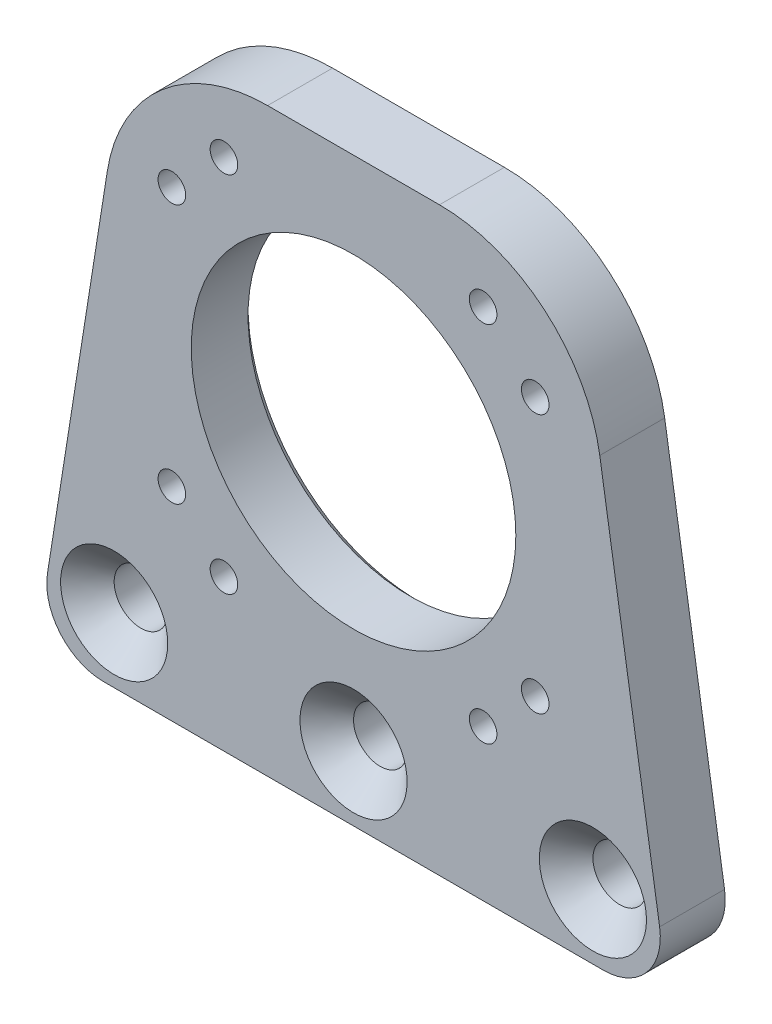
ISO-10303-21;
HEADER;
FILE_DESCRIPTION(('STEP AP214'),'2;1');
FILE_NAME('part.step','',(''),(''),'','','');
FILE_SCHEMA(('AUTOMOTIVE_DESIGN { 1 0 10303 214 1 1 1 1 }'));
ENDSEC;
DATA;
#1=APPLICATION_CONTEXT('core data for automotive mechanical design processes');
#2=APPLICATION_PROTOCOL_DEFINITION('international standard','automotive_design',2000,#1);
#3=PRODUCT_CONTEXT('',#1,'mechanical');
#4=PRODUCT('Part','Part','',(#3));
#5=PRODUCT_RELATED_PRODUCT_CATEGORY('part','',(#4));
#6=PRODUCT_DEFINITION_FORMATION('','',#4);
#7=PRODUCT_DEFINITION_CONTEXT('part definition',#1,'design');
#8=PRODUCT_DEFINITION('design','',#6,#7);
#9=PRODUCT_DEFINITION_SHAPE('','',#8);
#10=(LENGTH_UNIT() NAMED_UNIT(*) SI_UNIT(.MILLI.,.METRE.));
#11=(NAMED_UNIT(*) PLANE_ANGLE_UNIT() SI_UNIT($,.RADIAN.));
#12=(NAMED_UNIT(*) SI_UNIT($,.STERADIAN.) SOLID_ANGLE_UNIT());
#13=UNCERTAINTY_MEASURE_WITH_UNIT(LENGTH_MEASURE(1.E-05),#10,'distance_accuracy_value','');
#14=(GEOMETRIC_REPRESENTATION_CONTEXT(3) GLOBAL_UNCERTAINTY_ASSIGNED_CONTEXT((#13)) GLOBAL_UNIT_ASSIGNED_CONTEXT((#10,
#11,#12)) REPRESENTATION_CONTEXT('',''));
#15=CARTESIAN_POINT('',(0.,0.,0.));
#16=DIRECTION('',(0.,0.,1.));
#17=DIRECTION('',(1.,0.,0.));
#18=AXIS2_PLACEMENT_3D('',#15,#16,#17);
#19=CARTESIAN_POINT('',(-30.8054963273457,13.8,0.));
#20=DIRECTION('',(0.,0.,1.));
#21=DIRECTION('',(1.,0.,0.));
#22=AXIS2_PLACEMENT_3D('',#19,#20,#21);
#23=PLANE('',#22);
#24=CARTESIAN_POINT('',(0.,47.8,0.));
#25=DIRECTION('',(0.,0.,1.));
#26=DIRECTION('',(1.,0.,0.));
#27=AXIS2_PLACEMENT_3D('',#24,#25,#26);
#28=CIRCLE('',#27,21.);
#29=CARTESIAN_POINT('',(21.,47.8,0.));
#30=VERTEX_POINT('',#29);
#31=EDGE_CURVE('E47',#30,#30,#28,.T.);
#32=ORIENTED_EDGE('',*,*,#31,.T.);
#33=EDGE_LOOP('',(#32));
#34=FACE_BOUND('',#33,.T.);
#35=CARTESIAN_POINT('',(29.5,14.8,0.));
#36=DIRECTION('',(0.,0.,1.));
#37=DIRECTION('',(1.,0.,0.));
#38=AXIS2_PLACEMENT_3D('',#35,#36,#37);
#39=CIRCLE('',#38,3.3);
#40=CARTESIAN_POINT('',(32.8,14.8,0.));
#41=VERTEX_POINT('',#40);
#42=EDGE_CURVE('E215',#41,#41,#39,.T.);
#43=ORIENTED_EDGE('',*,*,#42,.T.);
#44=EDGE_LOOP('',(#43));
#45=FACE_BOUND('',#44,.T.);
#46=CARTESIAN_POINT('',(0.,14.8,0.));
#47=DIRECTION('',(0.,0.,1.));
#48=DIRECTION('',(1.,0.,0.));
#49=AXIS2_PLACEMENT_3D('',#46,#47,#48);
#50=CIRCLE('',#49,3.3);
#51=CARTESIAN_POINT('',(3.3,14.8,0.));
#52=VERTEX_POINT('',#51);
#53=EDGE_CURVE('E210',#52,#52,#50,.T.);
#54=ORIENTED_EDGE('',*,*,#53,.T.);
#55=EDGE_LOOP('',(#54));
#56=FACE_BOUND('',#55,.T.);
#57=CARTESIAN_POINT('',(-29.5,14.8,0.));
#58=DIRECTION('',(0.,0.,1.));
#59=DIRECTION('',(1.,0.,0.));
#60=AXIS2_PLACEMENT_3D('',#57,#58,#59);
#61=CIRCLE('',#60,3.3);
#62=CARTESIAN_POINT('',(-26.2,14.8,0.));
#63=VERTEX_POINT('',#62);
#64=EDGE_CURVE('E205',#63,#63,#61,.T.);
#65=ORIENTED_EDGE('',*,*,#64,.T.);
#66=EDGE_LOOP('',(#65));
#67=FACE_BOUND('',#66,.T.);
#68=CARTESIAN_POINT('',(15.9693312820508,25.4118232452012,0.));
#69=DIRECTION('',(0.,0.,-1.));
#70=DIRECTION('',(-1.,0.,0.));
#71=AXIS2_PLACEMENT_3D('',#68,#69,#70);
#72=CIRCLE('',#71,3.3);
#73=CARTESIAN_POINT('',(12.6693312820508,25.4118232452012,0.));
#74=VERTEX_POINT('',#73);
#75=EDGE_CURVE('E183',#74,#74,#72,.T.);
#76=ORIENTED_EDGE('',*,*,#75,.F.);
#77=EDGE_LOOP('',(#76));
#78=FACE_BOUND('',#77,.T.);
#79=CARTESIAN_POINT('',(-30.8054963273457,13.8,0.));
#80=DIRECTION('',(0.,0.,1.));
#81=DIRECTION('',(1.,0.,0.));
#82=AXIS2_PLACEMENT_3D('',#79,#80,#81);
#83=CIRCLE('',#82,7.);
#84=CARTESIAN_POINT('',(-37.7195050868033,14.89383859602,0.));
#85=VERTEX_POINT('',#84);
#86=CARTESIAN_POINT('',(-30.8054963273457,6.80000000000001,0.));
#87=VERTEX_POINT('',#86);
#88=EDGE_CURVE('E136',#85,#87,#83,.T.);
#89=ORIENTED_EDGE('',*,*,#88,.F.);
#90=DIRECTION('',(-0.156262656574284,-0.987715537065378,0.));
#91=VECTOR('',#90,1.);
#92=CARTESIAN_POINT('',(-37.7195050868033,14.89383859602,0.));
#93=LINE('',#92,#91);
#94=CARTESIAN_POINT('',(-30.3437932099042,61.5147356000824,0.));
#95=VERTEX_POINT('',#94);
#96=EDGE_CURVE('E90',#95,#85,#93,.T.);
#97=ORIENTED_EDGE('',*,*,#96,.F.);
#98=CARTESIAN_POINT('',(-10.5894824685967,58.3894824685967,0.));
#99=DIRECTION('',(0.,0.,1.));
#100=DIRECTION('',(-1.,0.,0.));
#101=AXIS2_PLACEMENT_3D('',#98,#99,#100);
#102=CIRCLE('',#101,20.);
#103=CARTESIAN_POINT('',(-10.5894824685967,78.3894824685967,0.));
#104=VERTEX_POINT('',#103);
#105=EDGE_CURVE('E84',#104,#95,#102,.T.);
#106=ORIENTED_EDGE('',*,*,#105,.F.);
#107=DIRECTION('',(-1.,0.,0.));
#108=VECTOR('',#107,1.);
#109=CARTESIAN_POINT('',(-10.5894824685967,78.3894824685967,0.));
#110=LINE('',#109,#108);
#111=CARTESIAN_POINT('',(10.5894824685967,78.3894824685967,0.));
#112=VERTEX_POINT('',#111);
#113=EDGE_CURVE('E126',#112,#104,#110,.T.);
#114=ORIENTED_EDGE('',*,*,#113,.F.);
#115=CARTESIAN_POINT('',(10.5894824685967,58.3894824685967,0.));
#116=DIRECTION('',(0.,0.,1.));
#117=DIRECTION('',(1.,0.,0.));
#118=AXIS2_PLACEMENT_3D('',#115,#116,#117);
#119=CIRCLE('',#118,20.);
#120=CARTESIAN_POINT('',(30.3437932099042,61.5147356000824,0.));
#121=VERTEX_POINT('',#120);
#122=EDGE_CURVE('E146',#121,#112,#119,.T.);
#123=ORIENTED_EDGE('',*,*,#122,.F.);
#124=DIRECTION('',(-0.156262656574284,0.987715537065378,0.));
#125=VECTOR('',#124,1.);
#126=CARTESIAN_POINT('',(37.7195050868033,14.89383859602,0.));
#127=LINE('',#126,#125);
#128=CARTESIAN_POINT('',(37.7195050868033,14.89383859602,0.));
#129=VERTEX_POINT('',#128);
#130=EDGE_CURVE('E144',#129,#121,#127,.T.);
#131=ORIENTED_EDGE('',*,*,#130,.F.);
#132=CARTESIAN_POINT('',(30.8054963273457,13.8,0.));
#133=DIRECTION('',(0.,0.,1.));
#134=DIRECTION('',(-1.,0.,0.));
#135=AXIS2_PLACEMENT_3D('',#132,#133,#134);
#136=CIRCLE('',#135,7.00000000000001);
#137=CARTESIAN_POINT('',(30.8054963273457,6.8,0.));
#138=VERTEX_POINT('',#137);
#139=EDGE_CURVE('E142',#138,#129,#136,.T.);
#140=ORIENTED_EDGE('',*,*,#139,.F.);
#141=DIRECTION('',(1.,0.,0.));
#142=VECTOR('',#141,1.);
#143=CARTESIAN_POINT('',(-30.8054963273457,6.80000000000001,0.));
#144=LINE('',#143,#142);
#145=EDGE_CURVE('E139',#87,#138,#144,.T.);
#146=ORIENTED_EDGE('',*,*,#145,.F.);
#147=EDGE_LOOP('',(#89,#97,#106,#114,#123,#131,#140,#146));
#148=FACE_BOUND('',#147,.T.);
#149=CARTESIAN_POINT('',(-22.3881767547988,31.8306687179492,0.));
#150=DIRECTION('',(0.,0.,-1.));
#151=DIRECTION('',(-1.,0.,0.));
#152=AXIS2_PLACEMENT_3D('',#149,#150,#151);
#153=CIRCLE('',#152,3.3);
#154=CARTESIAN_POINT('',(-25.6881767547988,31.8306687179492,0.));
#155=VERTEX_POINT('',#154);
#156=EDGE_CURVE('E173',#155,#155,#153,.T.);
#157=ORIENTED_EDGE('',*,*,#156,.F.);
#158=EDGE_LOOP('',(#157));
#159=FACE_BOUND('',#158,.T.);
#160=CARTESIAN_POINT('',(-15.9693312820508,25.4118232452012,0.));
#161=DIRECTION('',(0.,0.,-1.));
#162=DIRECTION('',(-1.,0.,0.));
#163=AXIS2_PLACEMENT_3D('',#160,#161,#162);
#164=CIRCLE('',#163,3.3);
#165=CARTESIAN_POINT('',(-19.2693312820508,25.4118232452012,0.));
#166=VERTEX_POINT('',#165);
#167=EDGE_CURVE('E178',#166,#166,#164,.T.);
#168=ORIENTED_EDGE('',*,*,#167,.F.);
#169=EDGE_LOOP('',(#168));
#170=FACE_BOUND('',#169,.T.);
#171=CARTESIAN_POINT('',(22.3881767547988,31.8306687179492,0.));
#172=DIRECTION('',(0.,0.,-1.));
#173=DIRECTION('',(-1.,0.,0.));
#174=AXIS2_PLACEMENT_3D('',#171,#172,#173);
#175=CIRCLE('',#174,3.3);
#176=CARTESIAN_POINT('',(19.0881767547988,31.8306687179492,0.));
#177=VERTEX_POINT('',#176);
#178=EDGE_CURVE('E188',#177,#177,#175,.T.);
#179=ORIENTED_EDGE('',*,*,#178,.F.);
#180=EDGE_LOOP('',(#179));
#181=FACE_BOUND('',#180,.T.);
#182=CARTESIAN_POINT('',(-22.3881767547988,63.7693312820508,0.));
#183=DIRECTION('',(0.,0.,-1.));
#184=DIRECTION('',(-1.,0.,0.));
#185=AXIS2_PLACEMENT_3D('',#182,#183,#184);
#186=CIRCLE('',#185,3.3);
#187=CARTESIAN_POINT('',(-25.6881767547988,63.7693312820508,0.));
#188=VERTEX_POINT('',#187);
#189=EDGE_CURVE('E193',#188,#188,#186,.T.);
#190=ORIENTED_EDGE('',*,*,#189,.F.);
#191=EDGE_LOOP('',(#190));
#192=FACE_BOUND('',#191,.T.);
#193=CARTESIAN_POINT('',(-15.9693312820508,70.1881767547988,0.));
#194=DIRECTION('',(0.,0.,-1.));
#195=DIRECTION('',(-1.,0.,0.));
#196=AXIS2_PLACEMENT_3D('',#193,#194,#195);
#197=CIRCLE('',#196,3.3);
#198=CARTESIAN_POINT('',(-19.2693312820508,70.1881767547988,0.));
#199=VERTEX_POINT('',#198);
#200=EDGE_CURVE('E198',#199,#199,#197,.T.);
#201=ORIENTED_EDGE('',*,*,#200,.F.);
#202=EDGE_LOOP('',(#201));
#203=FACE_BOUND('',#202,.T.);
#204=CARTESIAN_POINT('',(15.9693312820508,70.1881767547988,0.));
#205=DIRECTION('',(0.,0.,-1.));
#206=DIRECTION('',(-1.,0.,0.));
#207=AXIS2_PLACEMENT_3D('',#204,#205,#206);
#208=CIRCLE('',#207,3.3);
#209=CARTESIAN_POINT('',(12.6693312820508,70.1881767547988,0.));
#210=VERTEX_POINT('',#209);
#211=EDGE_CURVE('E203',#210,#210,#208,.T.);
#212=ORIENTED_EDGE('',*,*,#211,.F.);
#213=EDGE_LOOP('',(#212));
#214=FACE_BOUND('',#213,.T.);
#215=CARTESIAN_POINT('',(22.3881767547988,63.7693312820508,0.));
#216=DIRECTION('',(0.,0.,-1.));
#217=DIRECTION('',(-1.,0.,0.));
#218=AXIS2_PLACEMENT_3D('',#215,#216,#217);
#219=CIRCLE('',#218,3.3);
#220=CARTESIAN_POINT('',(19.0881767547988,63.7693312820508,0.));
#221=VERTEX_POINT('',#220);
#222=EDGE_CURVE('E208',#221,#221,#219,.T.);
#223=ORIENTED_EDGE('',*,*,#222,.F.);
#224=EDGE_LOOP('',(#223));
#225=FACE_BOUND('',#224,.T.);
#226=ADVANCED_FACE('F37',(#34,#45,#56,#67,#78,#148,#159,#170,#181,#192,#203,#214,#225),#23,.F.);
#227=CARTESIAN_POINT('',(-30.8054963273457,13.8,8.));
#228=DIRECTION('',(0.,0.,1.));
#229=DIRECTION('',(1.,0.,0.));
#230=AXIS2_PLACEMENT_3D('',#227,#228,#229);
#231=PLANE('',#230);
#232=CARTESIAN_POINT('',(29.5,14.8,8.));
#233=DIRECTION('',(0.,0.,1.));
#234=DIRECTION('',(1.,0.,0.));
#235=AXIS2_PLACEMENT_3D('',#232,#233,#234);
#236=CIRCLE('',#235,6.6);
#237=CARTESIAN_POINT('',(36.1,14.8,8.));
#238=VERTEX_POINT('',#237);
#239=EDGE_CURVE('E331',#238,#238,#236,.T.);
#240=ORIENTED_EDGE('',*,*,#239,.F.);
#241=EDGE_LOOP('',(#240));
#242=FACE_BOUND('',#241,.T.);
#243=CARTESIAN_POINT('',(0.,14.8,8.));
#244=DIRECTION('',(0.,0.,1.));
#245=DIRECTION('',(1.,0.,0.));
#246=AXIS2_PLACEMENT_3D('',#243,#244,#245);
#247=CIRCLE('',#246,6.6);
#248=CARTESIAN_POINT('',(6.6,14.8,8.));
#249=VERTEX_POINT('',#248);
#250=EDGE_CURVE('E217',#249,#249,#247,.T.);
#251=ORIENTED_EDGE('',*,*,#250,.F.);
#252=EDGE_LOOP('',(#251));
#253=FACE_BOUND('',#252,.T.);
#254=CARTESIAN_POINT('',(-29.5,14.8,8.));
#255=DIRECTION('',(0.,0.,1.));
#256=DIRECTION('',(1.,0.,0.));
#257=AXIS2_PLACEMENT_3D('',#254,#255,#256);
#258=CIRCLE('',#257,6.6);
#259=CARTESIAN_POINT('',(-22.9,14.8,8.));
#260=VERTEX_POINT('',#259);
#261=EDGE_CURVE('E213',#260,#260,#258,.T.);
#262=ORIENTED_EDGE('',*,*,#261,.F.);
#263=EDGE_LOOP('',(#262));
#264=FACE_BOUND('',#263,.T.);
#265=CARTESIAN_POINT('',(22.3881767547988,63.7693312820508,8.));
#266=DIRECTION('',(0.,0.,1.));
#267=DIRECTION('',(1.,0.,0.));
#268=AXIS2_PLACEMENT_3D('',#265,#266,#267);
#269=CIRCLE('',#268,1.7);
#270=CARTESIAN_POINT('',(24.0881767547988,63.7693312820508,8.));
#271=VERTEX_POINT('',#270);
#272=EDGE_CURVE('E200',#271,#271,#269,.T.);
#273=ORIENTED_EDGE('',*,*,#272,.F.);
#274=EDGE_LOOP('',(#273));
#275=FACE_BOUND('',#274,.T.);
#276=CARTESIAN_POINT('',(15.9693312820508,70.1881767547988,8.));
#277=DIRECTION('',(0.,0.,1.));
#278=DIRECTION('',(1.,0.,0.));
#279=AXIS2_PLACEMENT_3D('',#276,#277,#278);
#280=CIRCLE('',#279,1.7);
#281=CARTESIAN_POINT('',(17.6693312820508,70.1881767547988,8.));
#282=VERTEX_POINT('',#281);
#283=EDGE_CURVE('E195',#282,#282,#280,.T.);
#284=ORIENTED_EDGE('',*,*,#283,.F.);
#285=EDGE_LOOP('',(#284));
#286=FACE_BOUND('',#285,.T.);
#287=CARTESIAN_POINT('',(-15.9693312820508,70.1881767547988,8.));
#288=DIRECTION('',(0.,0.,1.));
#289=DIRECTION('',(1.,0.,0.));
#290=AXIS2_PLACEMENT_3D('',#287,#288,#289);
#291=CIRCLE('',#290,1.7);
#292=CARTESIAN_POINT('',(-14.2693312820508,70.1881767547988,8.));
#293=VERTEX_POINT('',#292);
#294=EDGE_CURVE('E190',#293,#293,#291,.T.);
#295=ORIENTED_EDGE('',*,*,#294,.F.);
#296=EDGE_LOOP('',(#295));
#297=FACE_BOUND('',#296,.T.);
#298=CARTESIAN_POINT('',(-22.3881767547988,63.7693312820508,8.));
#299=DIRECTION('',(0.,0.,1.));
#300=DIRECTION('',(1.,0.,0.));
#301=AXIS2_PLACEMENT_3D('',#298,#299,#300);
#302=CIRCLE('',#301,1.7);
#303=CARTESIAN_POINT('',(-20.6881767547988,63.7693312820508,8.));
#304=VERTEX_POINT('',#303);
#305=EDGE_CURVE('E185',#304,#304,#302,.T.);
#306=ORIENTED_EDGE('',*,*,#305,.F.);
#307=EDGE_LOOP('',(#306));
#308=FACE_BOUND('',#307,.T.);
#309=CARTESIAN_POINT('',(22.3881767547988,31.8306687179492,8.));
#310=DIRECTION('',(0.,0.,1.));
#311=DIRECTION('',(1.,0.,0.));
#312=AXIS2_PLACEMENT_3D('',#309,#310,#311);
#313=CIRCLE('',#312,1.7);
#314=CARTESIAN_POINT('',(24.0881767547988,31.8306687179492,8.));
#315=VERTEX_POINT('',#314);
#316=EDGE_CURVE('E180',#315,#315,#313,.T.);
#317=ORIENTED_EDGE('',*,*,#316,.F.);
#318=EDGE_LOOP('',(#317));
#319=FACE_BOUND('',#318,.T.);
#320=CARTESIAN_POINT('',(15.9693312820508,25.4118232452012,8.));
#321=DIRECTION('',(0.,0.,1.));
#322=DIRECTION('',(1.,0.,0.));
#323=AXIS2_PLACEMENT_3D('',#320,#321,#322);
#324=CIRCLE('',#323,1.7);
#325=CARTESIAN_POINT('',(17.6693312820508,25.4118232452012,8.));
#326=VERTEX_POINT('',#325);
#327=EDGE_CURVE('E175',#326,#326,#324,.T.);
#328=ORIENTED_EDGE('',*,*,#327,.F.);
#329=EDGE_LOOP('',(#328));
#330=FACE_BOUND('',#329,.T.);
#331=CARTESIAN_POINT('',(-15.9693312820508,25.4118232452012,8.));
#332=DIRECTION('',(0.,0.,1.));
#333=DIRECTION('',(1.,0.,0.));
#334=AXIS2_PLACEMENT_3D('',#331,#332,#333);
#335=CIRCLE('',#334,1.7);
#336=CARTESIAN_POINT('',(-14.2693312820508,25.4118232452012,8.));
#337=VERTEX_POINT('',#336);
#338=EDGE_CURVE('E170',#337,#337,#335,.T.);
#339=ORIENTED_EDGE('',*,*,#338,.F.);
#340=EDGE_LOOP('',(#339));
#341=FACE_BOUND('',#340,.T.);
#342=CARTESIAN_POINT('',(-22.3881767547988,31.8306687179492,8.));
#343=DIRECTION('',(0.,0.,1.));
#344=DIRECTION('',(1.,0.,0.));
#345=AXIS2_PLACEMENT_3D('',#342,#343,#344);
#346=CIRCLE('',#345,1.7);
#347=CARTESIAN_POINT('',(-20.6881767547988,31.8306687179492,8.));
#348=VERTEX_POINT('',#347);
#349=EDGE_CURVE('E166',#348,#348,#346,.T.);
#350=ORIENTED_EDGE('',*,*,#349,.F.);
#351=EDGE_LOOP('',(#350));
#352=FACE_BOUND('',#351,.T.);
#353=CARTESIAN_POINT('',(0.,47.8,8.));
#354=DIRECTION('',(0.,0.,1.));
#355=DIRECTION('',(1.,0.,0.));
#356=AXIS2_PLACEMENT_3D('',#353,#354,#355);
#357=CIRCLE('',#356,20.);
#358=CARTESIAN_POINT('',(20.,47.8,8.));
#359=VERTEX_POINT('',#358);
#360=EDGE_CURVE('E140',#359,#359,#357,.T.);
#361=ORIENTED_EDGE('',*,*,#360,.F.);
#362=EDGE_LOOP('',(#361));
#363=FACE_BOUND('',#362,.T.);
#364=CARTESIAN_POINT('',(-30.8054963273457,13.8,8.));
#365=DIRECTION('',(0.,0.,1.));
#366=DIRECTION('',(1.,0.,0.));
#367=AXIS2_PLACEMENT_3D('',#364,#365,#366);
#368=CIRCLE('',#367,7.);
#369=CARTESIAN_POINT('',(-37.7195050868033,14.89383859602,8.));
#370=VERTEX_POINT('',#369);
#371=CARTESIAN_POINT('',(-30.8054963273457,6.80000000000001,8.));
#372=VERTEX_POINT('',#371);
#373=EDGE_CURVE('E151',#370,#372,#368,.T.);
#374=ORIENTED_EDGE('',*,*,#373,.T.);
#375=DIRECTION('',(1.,0.,0.));
#376=VECTOR('',#375,1.);
#377=CARTESIAN_POINT('',(-30.8054963273457,6.80000000000001,8.));
#378=LINE('',#377,#376);
#379=CARTESIAN_POINT('',(30.8054963273457,6.8,8.));
#380=VERTEX_POINT('',#379);
#381=EDGE_CURVE('E99',#372,#380,#378,.T.);
#382=ORIENTED_EDGE('',*,*,#381,.T.);
#383=CARTESIAN_POINT('',(30.8054963273457,13.8,8.));
#384=DIRECTION('',(0.,0.,1.));
#385=DIRECTION('',(-1.,0.,0.));
#386=AXIS2_PLACEMENT_3D('',#383,#384,#385);
#387=CIRCLE('',#386,7.00000000000001);
#388=CARTESIAN_POINT('',(37.7195050868033,14.89383859602,8.));
#389=VERTEX_POINT('',#388);
#390=EDGE_CURVE('E279',#380,#389,#387,.T.);
#391=ORIENTED_EDGE('',*,*,#390,.T.);
#392=DIRECTION('',(-0.156262656574284,0.987715537065378,0.));
#393=VECTOR('',#392,1.);
#394=CARTESIAN_POINT('',(37.7195050868033,14.89383859602,8.));
#395=LINE('',#394,#393);
#396=CARTESIAN_POINT('',(30.3437932099042,61.5147356000824,8.));
#397=VERTEX_POINT('',#396);
#398=EDGE_CURVE('E281',#389,#397,#395,.T.);
#399=ORIENTED_EDGE('',*,*,#398,.T.);
#400=CARTESIAN_POINT('',(10.5894824685967,58.3894824685967,8.));
#401=DIRECTION('',(0.,0.,1.));
#402=DIRECTION('',(1.,0.,0.));
#403=AXIS2_PLACEMENT_3D('',#400,#401,#402);
#404=CIRCLE('',#403,20.);
#405=CARTESIAN_POINT('',(10.5894824685967,78.3894824685967,8.));
#406=VERTEX_POINT('',#405);
#407=EDGE_CURVE('E118',#397,#406,#404,.T.);
#408=ORIENTED_EDGE('',*,*,#407,.T.);
#409=DIRECTION('',(-1.,0.,0.));
#410=VECTOR('',#409,1.);
#411=CARTESIAN_POINT('',(-10.5894824685967,78.3894824685967,8.));
#412=LINE('',#411,#410);
#413=CARTESIAN_POINT('',(-10.5894824685967,78.3894824685967,8.));
#414=VERTEX_POINT('',#413);
#415=EDGE_CURVE('E112',#406,#414,#412,.T.);
#416=ORIENTED_EDGE('',*,*,#415,.T.);
#417=CARTESIAN_POINT('',(-10.5894824685967,58.3894824685967,8.));
#418=DIRECTION('',(0.,0.,1.));
#419=DIRECTION('',(-1.,0.,0.));
#420=AXIS2_PLACEMENT_3D('',#417,#418,#419);
#421=CIRCLE('',#420,20.);
#422=CARTESIAN_POINT('',(-30.3437932099042,61.5147356000824,8.));
#423=VERTEX_POINT('',#422);
#424=EDGE_CURVE('E116',#414,#423,#421,.T.);
#425=ORIENTED_EDGE('',*,*,#424,.T.);
#426=DIRECTION('',(-0.156262656574284,-0.987715537065378,0.));
#427=VECTOR('',#426,1.);
#428=CARTESIAN_POINT('',(-37.7195050868033,14.89383859602,8.));
#429=LINE('',#428,#427);
#430=EDGE_CURVE('E55',#423,#370,#429,.T.);
#431=ORIENTED_EDGE('',*,*,#430,.T.);
#432=EDGE_LOOP('',(#374,#382,#391,#399,#408,#416,#425,#431));
#433=FACE_BOUND('',#432,.T.);
#434=ADVANCED_FACE('F114',(#242,#253,#264,#275,#286,#297,#308,#319,#330,#341,#352,#363,#433),
#231,.T.);
#435=CARTESIAN_POINT('',(-30.8054963273457,13.8,8.));
#436=DIRECTION('',(0.,0.,-1.));
#437=DIRECTION('',(-1.,0.,0.));
#438=AXIS2_PLACEMENT_3D('',#435,#436,#437);
#439=CYLINDRICAL_SURFACE('',#438,7.);
#440=ORIENTED_EDGE('',*,*,#88,.T.);
#441=DIRECTION('',(0.,0.,-1.));
#442=VECTOR('',#441,1.);
#443=CARTESIAN_POINT('',(-30.8054963273457,6.80000000000001,8.));
#444=LINE('',#443,#442);
#445=EDGE_CURVE('E164',#372,#87,#444,.T.);
#446=ORIENTED_EDGE('',*,*,#445,.F.);
#447=ORIENTED_EDGE('',*,*,#373,.F.);
#448=DIRECTION('',(0.,0.,-1.));
#449=VECTOR('',#448,1.);
#450=CARTESIAN_POINT('',(-37.7195050868033,14.89383859602,8.));
#451=LINE('',#450,#449);
#452=EDGE_CURVE('E132',#370,#85,#451,.T.);
#453=ORIENTED_EDGE('',*,*,#452,.T.);
#454=EDGE_LOOP('',(#440,#446,#447,#453));
#455=FACE_BOUND('',#454,.T.);
#456=ADVANCED_FACE('F239',(#455),#439,.T.);
#457=CARTESIAN_POINT('',(-30.8054963273457,6.80000000000001,8.));
#458=DIRECTION('',(0.,1.,0.));
#459=DIRECTION('',(-1.,0.,0.));
#460=AXIS2_PLACEMENT_3D('',#457,#458,#459);
#461=PLANE('',#460);
#462=ORIENTED_EDGE('',*,*,#145,.T.);
#463=DIRECTION('',(0.,0.,-1.));
#464=VECTOR('',#463,1.);
#465=CARTESIAN_POINT('',(30.8054963273457,6.8,8.));
#466=LINE('',#465,#464);
#467=EDGE_CURVE('E161',#380,#138,#466,.T.);
#468=ORIENTED_EDGE('',*,*,#467,.F.);
#469=ORIENTED_EDGE('',*,*,#381,.F.);
#470=ORIENTED_EDGE('',*,*,#445,.T.);
#471=EDGE_LOOP('',(#462,#468,#469,#470));
#472=FACE_BOUND('',#471,.T.);
#473=ADVANCED_FACE('F263',(#472),#461,.F.);
#474=CARTESIAN_POINT('',(30.8054963273457,13.8,8.));
#475=DIRECTION('',(0.,0.,-1.));
#476=DIRECTION('',(-1.,0.,0.));
#477=AXIS2_PLACEMENT_3D('',#474,#475,#476);
#478=CYLINDRICAL_SURFACE('',#477,7.00000000000001);
#479=ORIENTED_EDGE('',*,*,#139,.T.);
#480=DIRECTION('',(0.,0.,-1.));
#481=VECTOR('',#480,1.);
#482=CARTESIAN_POINT('',(37.7195050868033,14.89383859602,8.));
#483=LINE('',#482,#481);
#484=EDGE_CURVE('E158',#389,#129,#483,.T.);
#485=ORIENTED_EDGE('',*,*,#484,.F.);
#486=ORIENTED_EDGE('',*,*,#390,.F.);
#487=ORIENTED_EDGE('',*,*,#467,.T.);
#488=EDGE_LOOP('',(#479,#485,#486,#487));
#489=FACE_BOUND('',#488,.T.);
#490=ADVANCED_FACE('F259',(#489),#478,.T.);
#491=CARTESIAN_POINT('',(37.7195050868033,14.89383859602,8.));
#492=DIRECTION('',(-0.987715537065378,-0.156262656574284,0.));
#493=DIRECTION('',(0.156262656574284,-0.987715537065378,0.));
#494=AXIS2_PLACEMENT_3D('',#491,#492,#493);
#495=PLANE('',#494);
#496=ORIENTED_EDGE('',*,*,#130,.T.);
#497=DIRECTION('',(0.,0.,-1.));
#498=VECTOR('',#497,1.);
#499=CARTESIAN_POINT('',(30.3437932099042,61.5147356000824,8.));
#500=LINE('',#499,#498);
#501=EDGE_CURVE('E155',#397,#121,#500,.T.);
#502=ORIENTED_EDGE('',*,*,#501,.F.);
#503=ORIENTED_EDGE('',*,*,#398,.F.);
#504=ORIENTED_EDGE('',*,*,#484,.T.);
#505=EDGE_LOOP('',(#496,#502,#503,#504));
#506=FACE_BOUND('',#505,.T.);
#507=ADVANCED_FACE('F255',(#506),#495,.F.);
#508=CARTESIAN_POINT('',(10.5894824685967,58.3894824685967,8.));
#509=DIRECTION('',(0.,0.,-1.));
#510=DIRECTION('',(-1.,0.,0.));
#511=AXIS2_PLACEMENT_3D('',#508,#509,#510);
#512=CYLINDRICAL_SURFACE('',#511,20.);
#513=ORIENTED_EDGE('',*,*,#122,.T.);
#514=DIRECTION('',(0.,0.,-1.));
#515=VECTOR('',#514,1.);
#516=CARTESIAN_POINT('',(10.5894824685967,78.3894824685967,8.));
#517=LINE('',#516,#515);
#518=EDGE_CURVE('E127',#406,#112,#517,.T.);
#519=ORIENTED_EDGE('',*,*,#518,.F.);
#520=ORIENTED_EDGE('',*,*,#407,.F.);
#521=ORIENTED_EDGE('',*,*,#501,.T.);
#522=EDGE_LOOP('',(#513,#519,#520,#521));
#523=FACE_BOUND('',#522,.T.);
#524=ADVANCED_FACE('F252',(#523),#512,.T.);
#525=CARTESIAN_POINT('',(-10.5894824685967,78.3894824685967,8.));
#526=DIRECTION('',(0.,-1.,0.));
#527=DIRECTION('',(0.,0.,-1.));
#528=AXIS2_PLACEMENT_3D('',#525,#526,#527);
#529=PLANE('',#528);
#530=ORIENTED_EDGE('',*,*,#113,.T.);
#531=DIRECTION('',(0.,0.,-1.));
#532=VECTOR('',#531,1.);
#533=CARTESIAN_POINT('',(-10.5894824685967,78.3894824685967,8.));
#534=LINE('',#533,#532);
#535=EDGE_CURVE('E123',#414,#104,#534,.T.);
#536=ORIENTED_EDGE('',*,*,#535,.F.);
#537=ORIENTED_EDGE('',*,*,#415,.F.);
#538=ORIENTED_EDGE('',*,*,#518,.T.);
#539=EDGE_LOOP('',(#530,#536,#537,#538));
#540=FACE_BOUND('',#539,.T.);
#541=ADVANCED_FACE('F124',(#540),#529,.F.);
#542=CARTESIAN_POINT('',(-10.5894824685967,58.3894824685967,8.));
#543=DIRECTION('',(0.,0.,-1.));
#544=DIRECTION('',(-1.,0.,0.));
#545=AXIS2_PLACEMENT_3D('',#542,#543,#544);
#546=CYLINDRICAL_SURFACE('',#545,20.);
#547=ORIENTED_EDGE('',*,*,#105,.T.);
#548=DIRECTION('',(0.,0.,-1.));
#549=VECTOR('',#548,1.);
#550=CARTESIAN_POINT('',(-30.3437932099042,61.5147356000824,8.));
#551=LINE('',#550,#549);
#552=EDGE_CURVE('E128',#423,#95,#551,.T.);
#553=ORIENTED_EDGE('',*,*,#552,.F.);
#554=ORIENTED_EDGE('',*,*,#424,.F.);
#555=ORIENTED_EDGE('',*,*,#535,.T.);
#556=EDGE_LOOP('',(#547,#553,#554,#555));
#557=FACE_BOUND('',#556,.T.);
#558=ADVANCED_FACE('F130',(#557),#546,.T.);
#559=CARTESIAN_POINT('',(-37.7195050868033,14.89383859602,8.));
#560=DIRECTION('',(0.987715537065378,-0.156262656574284,0.));
#561=DIRECTION('',(0.156262656574284,0.987715537065378,0.));
#562=AXIS2_PLACEMENT_3D('',#559,#560,#561);
#563=PLANE('',#562);
#564=ORIENTED_EDGE('',*,*,#96,.T.);
#565=ORIENTED_EDGE('',*,*,#452,.F.);
#566=ORIENTED_EDGE('',*,*,#430,.F.);
#567=ORIENTED_EDGE('',*,*,#552,.T.);
#568=EDGE_LOOP('',(#564,#565,#566,#567));
#569=FACE_BOUND('',#568,.T.);
#570=ADVANCED_FACE('F244',(#569),#563,.F.);
#571=CARTESIAN_POINT('',(0.,47.8,8.));
#572=DIRECTION('',(0.,0.,-1.));
#573=DIRECTION('',(-1.,0.,0.));
#574=AXIS2_PLACEMENT_3D('',#571,#572,#573);
#575=CYLINDRICAL_SURFACE('',#574,20.);
#576=CARTESIAN_POINT('',(0.,47.8,0.999999999999987));
#577=DIRECTION('',(0.,0.,1.));
#578=DIRECTION('',(1.,0.,0.));
#579=AXIS2_PLACEMENT_3D('',#576,#577,#578);
#580=CIRCLE('',#579,20.);
#581=CARTESIAN_POINT('',(20.,47.8,0.999999999999987));
#582=VERTEX_POINT('',#581);
#583=EDGE_CURVE('E11',#582,#582,#580,.F.);
#584=ORIENTED_EDGE('',*,*,#583,.T.);
#585=EDGE_LOOP('',(#584));
#586=FACE_BOUND('',#585,.T.);
#587=ORIENTED_EDGE('',*,*,#360,.T.);
#588=EDGE_LOOP('',(#587));
#589=FACE_BOUND('',#588,.T.);
#590=ADVANCED_FACE('F247',(#586,#589),#575,.F.);
#591=CARTESIAN_POINT('',(-22.3881767547988,31.8306687179492,0.));
#592=DIRECTION('',(0.,0.,-1.));
#593=DIRECTION('',(-1.,0.,0.));
#594=AXIS2_PLACEMENT_3D('',#591,#592,#593);
#595=CYLINDRICAL_SURFACE('',#594,1.7);
#596=ORIENTED_EDGE('',*,*,#349,.T.);
#597=EDGE_LOOP('',(#596));
#598=FACE_BOUND('',#597,.T.);
#599=CARTESIAN_POINT('',(-22.3881767547988,31.8306687179492,1.6));
#600=DIRECTION('',(0.,0.,-1.));
#601=DIRECTION('',(-1.,0.,0.));
#602=AXIS2_PLACEMENT_3D('',#599,#600,#601);
#603=CIRCLE('',#602,1.7);
#604=CARTESIAN_POINT('',(-24.0881767547988,31.8306687179492,1.6));
#605=VERTEX_POINT('',#604);
#606=EDGE_CURVE('E169',#605,#605,#603,.T.);
#607=ORIENTED_EDGE('',*,*,#606,.T.);
#608=EDGE_LOOP('',(#607));
#609=FACE_BOUND('',#608,.T.);
#610=ADVANCED_FACE('F359',(#598,#609),#595,.F.);
#611=CARTESIAN_POINT('',(-22.3881767547988,31.8306687179492,0.));
#612=DIRECTION('',(0.,0.,-1.));
#613=DIRECTION('',(-1.,0.,0.));
#614=AXIS2_PLACEMENT_3D('',#611,#612,#613);
#615=CONICAL_SURFACE('',#614,3.3,0.785398163397449);
#616=ORIENTED_EDGE('',*,*,#606,.F.);
#617=EDGE_LOOP('',(#616));
#618=FACE_BOUND('',#617,.T.);
#619=ORIENTED_EDGE('',*,*,#156,.T.);
#620=EDGE_LOOP('',(#619));
#621=FACE_BOUND('',#620,.T.);
#622=ADVANCED_FACE('F364',(#618,#621),#615,.F.);
#623=CARTESIAN_POINT('',(-15.9693312820508,25.4118232452012,0.));
#624=DIRECTION('',(0.,0.,-1.));
#625=DIRECTION('',(-1.,0.,0.));
#626=AXIS2_PLACEMENT_3D('',#623,#624,#625);
#627=CYLINDRICAL_SURFACE('',#626,1.7);
#628=ORIENTED_EDGE('',*,*,#338,.T.);
#629=EDGE_LOOP('',(#628));
#630=FACE_BOUND('',#629,.T.);
#631=CARTESIAN_POINT('',(-15.9693312820508,25.4118232452012,1.6));
#632=DIRECTION('',(0.,0.,-1.));
#633=DIRECTION('',(-1.,0.,0.));
#634=AXIS2_PLACEMENT_3D('',#631,#632,#633);
#635=CIRCLE('',#634,1.7);
#636=CARTESIAN_POINT('',(-17.6693312820508,25.4118232452012,1.6));
#637=VERTEX_POINT('',#636);
#638=EDGE_CURVE('E174',#637,#637,#635,.T.);
#639=ORIENTED_EDGE('',*,*,#638,.T.);
#640=EDGE_LOOP('',(#639));
#641=FACE_BOUND('',#640,.T.);
#642=ADVANCED_FACE('F370',(#630,#641),#627,.F.);
#643=CARTESIAN_POINT('',(-15.9693312820508,25.4118232452012,0.));
#644=DIRECTION('',(0.,0.,-1.));
#645=DIRECTION('',(-1.,0.,0.));
#646=AXIS2_PLACEMENT_3D('',#643,#644,#645);
#647=CONICAL_SURFACE('',#646,3.3,0.785398163397449);
#648=ORIENTED_EDGE('',*,*,#638,.F.);
#649=EDGE_LOOP('',(#648));
#650=FACE_BOUND('',#649,.T.);
#651=ORIENTED_EDGE('',*,*,#167,.T.);
#652=EDGE_LOOP('',(#651));
#653=FACE_BOUND('',#652,.T.);
#654=ADVANCED_FACE('F374',(#650,#653),#647,.F.);
#655=CARTESIAN_POINT('',(15.9693312820508,25.4118232452012,0.));
#656=DIRECTION('',(0.,0.,-1.));
#657=DIRECTION('',(-1.,0.,0.));
#658=AXIS2_PLACEMENT_3D('',#655,#656,#657);
#659=CYLINDRICAL_SURFACE('',#658,1.7);
#660=ORIENTED_EDGE('',*,*,#327,.T.);
#661=EDGE_LOOP('',(#660));
#662=FACE_BOUND('',#661,.T.);
#663=CARTESIAN_POINT('',(15.9693312820508,25.4118232452012,1.6));
#664=DIRECTION('',(0.,0.,-1.));
#665=DIRECTION('',(-1.,0.,0.));
#666=AXIS2_PLACEMENT_3D('',#663,#664,#665);
#667=CIRCLE('',#666,1.7);
#668=CARTESIAN_POINT('',(14.2693312820508,25.4118232452012,1.6));
#669=VERTEX_POINT('',#668);
#670=EDGE_CURVE('E179',#669,#669,#667,.T.);
#671=ORIENTED_EDGE('',*,*,#670,.T.);
#672=EDGE_LOOP('',(#671));
#673=FACE_BOUND('',#672,.T.);
#674=ADVANCED_FACE('F378',(#662,#673),#659,.F.);
#675=CARTESIAN_POINT('',(15.9693312820508,25.4118232452012,0.));
#676=DIRECTION('',(0.,0.,-1.));
#677=DIRECTION('',(-1.,0.,0.));
#678=AXIS2_PLACEMENT_3D('',#675,#676,#677);
#679=CONICAL_SURFACE('',#678,3.3,0.785398163397449);
#680=ORIENTED_EDGE('',*,*,#670,.F.);
#681=EDGE_LOOP('',(#680));
#682=FACE_BOUND('',#681,.T.);
#683=ORIENTED_EDGE('',*,*,#75,.T.);
#684=EDGE_LOOP('',(#683));
#685=FACE_BOUND('',#684,.T.);
#686=ADVANCED_FACE('F382',(#682,#685),#679,.F.);
#687=CARTESIAN_POINT('',(22.3881767547988,31.8306687179492,0.));
#688=DIRECTION('',(0.,0.,-1.));
#689=DIRECTION('',(-1.,0.,0.));
#690=AXIS2_PLACEMENT_3D('',#687,#688,#689);
#691=CYLINDRICAL_SURFACE('',#690,1.7);
#692=ORIENTED_EDGE('',*,*,#316,.T.);
#693=EDGE_LOOP('',(#692));
#694=FACE_BOUND('',#693,.T.);
#695=CARTESIAN_POINT('',(22.3881767547988,31.8306687179492,1.6));
#696=DIRECTION('',(0.,0.,-1.));
#697=DIRECTION('',(-1.,0.,0.));
#698=AXIS2_PLACEMENT_3D('',#695,#696,#697);
#699=CIRCLE('',#698,1.7);
#700=CARTESIAN_POINT('',(20.6881767547988,31.8306687179492,1.6));
#701=VERTEX_POINT('',#700);
#702=EDGE_CURVE('E184',#701,#701,#699,.T.);
#703=ORIENTED_EDGE('',*,*,#702,.T.);
#704=EDGE_LOOP('',(#703));
#705=FACE_BOUND('',#704,.T.);
#706=ADVANCED_FACE('F386',(#694,#705),#691,.F.);
#707=CARTESIAN_POINT('',(22.3881767547988,31.8306687179492,0.));
#708=DIRECTION('',(0.,0.,-1.));
#709=DIRECTION('',(-1.,0.,0.));
#710=AXIS2_PLACEMENT_3D('',#707,#708,#709);
#711=CONICAL_SURFACE('',#710,3.3,0.785398163397449);
#712=ORIENTED_EDGE('',*,*,#702,.F.);
#713=EDGE_LOOP('',(#712));
#714=FACE_BOUND('',#713,.T.);
#715=ORIENTED_EDGE('',*,*,#178,.T.);
#716=EDGE_LOOP('',(#715));
#717=FACE_BOUND('',#716,.T.);
#718=ADVANCED_FACE('F390',(#714,#717),#711,.F.);
#719=CARTESIAN_POINT('',(-22.3881767547988,63.7693312820508,0.));
#720=DIRECTION('',(0.,0.,-1.));
#721=DIRECTION('',(-1.,0.,0.));
#722=AXIS2_PLACEMENT_3D('',#719,#720,#721);
#723=CYLINDRICAL_SURFACE('',#722,1.7);
#724=ORIENTED_EDGE('',*,*,#305,.T.);
#725=EDGE_LOOP('',(#724));
#726=FACE_BOUND('',#725,.T.);
#727=CARTESIAN_POINT('',(-22.3881767547988,63.7693312820508,1.6));
#728=DIRECTION('',(0.,0.,-1.));
#729=DIRECTION('',(-1.,0.,0.));
#730=AXIS2_PLACEMENT_3D('',#727,#728,#729);
#731=CIRCLE('',#730,1.7);
#732=CARTESIAN_POINT('',(-24.0881767547988,63.7693312820508,1.6));
#733=VERTEX_POINT('',#732);
#734=EDGE_CURVE('E189',#733,#733,#731,.T.);
#735=ORIENTED_EDGE('',*,*,#734,.T.);
#736=EDGE_LOOP('',(#735));
#737=FACE_BOUND('',#736,.T.);
#738=ADVANCED_FACE('F394',(#726,#737),#723,.F.);
#739=CARTESIAN_POINT('',(-22.3881767547988,63.7693312820508,0.));
#740=DIRECTION('',(0.,0.,-1.));
#741=DIRECTION('',(-1.,0.,0.));
#742=AXIS2_PLACEMENT_3D('',#739,#740,#741);
#743=CONICAL_SURFACE('',#742,3.3,0.785398163397449);
#744=ORIENTED_EDGE('',*,*,#734,.F.);
#745=EDGE_LOOP('',(#744));
#746=FACE_BOUND('',#745,.T.);
#747=ORIENTED_EDGE('',*,*,#189,.T.);
#748=EDGE_LOOP('',(#747));
#749=FACE_BOUND('',#748,.T.);
#750=ADVANCED_FACE('F398',(#746,#749),#743,.F.);
#751=CARTESIAN_POINT('',(-15.9693312820508,70.1881767547988,0.));
#752=DIRECTION('',(0.,0.,-1.));
#753=DIRECTION('',(-1.,0.,0.));
#754=AXIS2_PLACEMENT_3D('',#751,#752,#753);
#755=CYLINDRICAL_SURFACE('',#754,1.7);
#756=ORIENTED_EDGE('',*,*,#294,.T.);
#757=EDGE_LOOP('',(#756));
#758=FACE_BOUND('',#757,.T.);
#759=CARTESIAN_POINT('',(-15.9693312820508,70.1881767547988,1.6));
#760=DIRECTION('',(0.,0.,-1.));
#761=DIRECTION('',(-1.,0.,0.));
#762=AXIS2_PLACEMENT_3D('',#759,#760,#761);
#763=CIRCLE('',#762,1.7);
#764=CARTESIAN_POINT('',(-17.6693312820508,70.1881767547988,1.6));
#765=VERTEX_POINT('',#764);
#766=EDGE_CURVE('E194',#765,#765,#763,.T.);
#767=ORIENTED_EDGE('',*,*,#766,.T.);
#768=EDGE_LOOP('',(#767));
#769=FACE_BOUND('',#768,.T.);
#770=ADVANCED_FACE('F402',(#758,#769),#755,.F.);
#771=CARTESIAN_POINT('',(-15.9693312820508,70.1881767547988,0.));
#772=DIRECTION('',(0.,0.,-1.));
#773=DIRECTION('',(-1.,0.,0.));
#774=AXIS2_PLACEMENT_3D('',#771,#772,#773);
#775=CONICAL_SURFACE('',#774,3.3,0.785398163397449);
#776=ORIENTED_EDGE('',*,*,#766,.F.);
#777=EDGE_LOOP('',(#776));
#778=FACE_BOUND('',#777,.T.);
#779=ORIENTED_EDGE('',*,*,#200,.T.);
#780=EDGE_LOOP('',(#779));
#781=FACE_BOUND('',#780,.T.);
#782=ADVANCED_FACE('F406',(#778,#781),#775,.F.);
#783=CARTESIAN_POINT('',(15.9693312820508,70.1881767547988,0.));
#784=DIRECTION('',(0.,0.,-1.));
#785=DIRECTION('',(-1.,0.,0.));
#786=AXIS2_PLACEMENT_3D('',#783,#784,#785);
#787=CYLINDRICAL_SURFACE('',#786,1.7);
#788=ORIENTED_EDGE('',*,*,#283,.T.);
#789=EDGE_LOOP('',(#788));
#790=FACE_BOUND('',#789,.T.);
#791=CARTESIAN_POINT('',(15.9693312820508,70.1881767547988,1.6));
#792=DIRECTION('',(0.,0.,-1.));
#793=DIRECTION('',(-1.,0.,0.));
#794=AXIS2_PLACEMENT_3D('',#791,#792,#793);
#795=CIRCLE('',#794,1.7);
#796=CARTESIAN_POINT('',(14.2693312820508,70.1881767547988,1.6));
#797=VERTEX_POINT('',#796);
#798=EDGE_CURVE('E199',#797,#797,#795,.T.);
#799=ORIENTED_EDGE('',*,*,#798,.T.);
#800=EDGE_LOOP('',(#799));
#801=FACE_BOUND('',#800,.T.);
#802=ADVANCED_FACE('F410',(#790,#801),#787,.F.);
#803=CARTESIAN_POINT('',(15.9693312820508,70.1881767547988,0.));
#804=DIRECTION('',(0.,0.,-1.));
#805=DIRECTION('',(-1.,0.,0.));
#806=AXIS2_PLACEMENT_3D('',#803,#804,#805);
#807=CONICAL_SURFACE('',#806,3.3,0.785398163397449);
#808=ORIENTED_EDGE('',*,*,#798,.F.);
#809=EDGE_LOOP('',(#808));
#810=FACE_BOUND('',#809,.T.);
#811=ORIENTED_EDGE('',*,*,#211,.T.);
#812=EDGE_LOOP('',(#811));
#813=FACE_BOUND('',#812,.T.);
#814=ADVANCED_FACE('F414',(#810,#813),#807,.F.);
#815=CARTESIAN_POINT('',(22.3881767547988,63.7693312820508,0.));
#816=DIRECTION('',(0.,0.,-1.));
#817=DIRECTION('',(-1.,0.,0.));
#818=AXIS2_PLACEMENT_3D('',#815,#816,#817);
#819=CYLINDRICAL_SURFACE('',#818,1.7);
#820=ORIENTED_EDGE('',*,*,#272,.T.);
#821=EDGE_LOOP('',(#820));
#822=FACE_BOUND('',#821,.T.);
#823=CARTESIAN_POINT('',(22.3881767547988,63.7693312820508,1.6));
#824=DIRECTION('',(0.,0.,-1.));
#825=DIRECTION('',(-1.,0.,0.));
#826=AXIS2_PLACEMENT_3D('',#823,#824,#825);
#827=CIRCLE('',#826,1.7);
#828=CARTESIAN_POINT('',(20.6881767547988,63.7693312820508,1.6));
#829=VERTEX_POINT('',#828);
#830=EDGE_CURVE('E204',#829,#829,#827,.T.);
#831=ORIENTED_EDGE('',*,*,#830,.T.);
#832=EDGE_LOOP('',(#831));
#833=FACE_BOUND('',#832,.T.);
#834=ADVANCED_FACE('F418',(#822,#833),#819,.F.);
#835=CARTESIAN_POINT('',(22.3881767547988,63.7693312820508,0.));
#836=DIRECTION('',(0.,0.,-1.));
#837=DIRECTION('',(-1.,0.,0.));
#838=AXIS2_PLACEMENT_3D('',#835,#836,#837);
#839=CONICAL_SURFACE('',#838,3.3,0.785398163397449);
#840=ORIENTED_EDGE('',*,*,#830,.F.);
#841=EDGE_LOOP('',(#840));
#842=FACE_BOUND('',#841,.T.);
#843=ORIENTED_EDGE('',*,*,#222,.T.);
#844=EDGE_LOOP('',(#843));
#845=FACE_BOUND('',#844,.T.);
#846=ADVANCED_FACE('F422',(#842,#845),#839,.F.);
#847=CARTESIAN_POINT('',(-29.5,14.8,8.));
#848=DIRECTION('',(0.,0.,1.));
#849=DIRECTION('',(1.,0.,0.));
#850=AXIS2_PLACEMENT_3D('',#847,#848,#849);
#851=CYLINDRICAL_SURFACE('',#850,3.3);
#852=CARTESIAN_POINT('',(-29.5,14.8,4.7));
#853=DIRECTION('',(0.,0.,1.));
#854=DIRECTION('',(1.,0.,0.));
#855=AXIS2_PLACEMENT_3D('',#852,#853,#854);
#856=CIRCLE('',#855,3.3);
#857=CARTESIAN_POINT('',(-26.2,14.8,4.7));
#858=VERTEX_POINT('',#857);
#859=EDGE_CURVE('E209',#858,#858,#856,.T.);
#860=ORIENTED_EDGE('',*,*,#859,.T.);
#861=EDGE_LOOP('',(#860));
#862=FACE_BOUND('',#861,.T.);
#863=ORIENTED_EDGE('',*,*,#64,.F.);
#864=EDGE_LOOP('',(#863));
#865=FACE_BOUND('',#864,.T.);
#866=ADVANCED_FACE('F426',(#862,#865),#851,.F.);
#867=CARTESIAN_POINT('',(-29.5,14.8,8.));
#868=DIRECTION('',(0.,0.,1.));
#869=DIRECTION('',(1.,0.,0.));
#870=AXIS2_PLACEMENT_3D('',#867,#868,#869);
#871=CONICAL_SURFACE('',#870,6.6,0.785398163397449);
#872=ORIENTED_EDGE('',*,*,#859,.F.);
#873=EDGE_LOOP('',(#872));
#874=FACE_BOUND('',#873,.T.);
#875=ORIENTED_EDGE('',*,*,#261,.T.);
#876=EDGE_LOOP('',(#875));
#877=FACE_BOUND('',#876,.T.);
#878=ADVANCED_FACE('F430',(#874,#877),#871,.F.);
#879=CARTESIAN_POINT('',(0.,14.8,8.));
#880=DIRECTION('',(0.,0.,1.));
#881=DIRECTION('',(1.,0.,0.));
#882=AXIS2_PLACEMENT_3D('',#879,#880,#881);
#883=CYLINDRICAL_SURFACE('',#882,3.3);
#884=CARTESIAN_POINT('',(0.,14.8,4.7));
#885=DIRECTION('',(0.,0.,1.));
#886=DIRECTION('',(1.,0.,0.));
#887=AXIS2_PLACEMENT_3D('',#884,#885,#886);
#888=CIRCLE('',#887,3.3);
#889=CARTESIAN_POINT('',(3.3,14.8,4.7));
#890=VERTEX_POINT('',#889);
#891=EDGE_CURVE('E214',#890,#890,#888,.T.);
#892=ORIENTED_EDGE('',*,*,#891,.T.);
#893=EDGE_LOOP('',(#892));
#894=FACE_BOUND('',#893,.T.);
#895=ORIENTED_EDGE('',*,*,#53,.F.);
#896=EDGE_LOOP('',(#895));
#897=FACE_BOUND('',#896,.T.);
#898=ADVANCED_FACE('F434',(#894,#897),#883,.F.);
#899=CARTESIAN_POINT('',(0.,14.8,8.));
#900=DIRECTION('',(0.,0.,1.));
#901=DIRECTION('',(1.,0.,0.));
#902=AXIS2_PLACEMENT_3D('',#899,#900,#901);
#903=CONICAL_SURFACE('',#902,6.6,0.785398163397449);
#904=ORIENTED_EDGE('',*,*,#891,.F.);
#905=EDGE_LOOP('',(#904));
#906=FACE_BOUND('',#905,.T.);
#907=ORIENTED_EDGE('',*,*,#250,.T.);
#908=EDGE_LOOP('',(#907));
#909=FACE_BOUND('',#908,.T.);
#910=ADVANCED_FACE('F438',(#906,#909),#903,.F.);
#911=CARTESIAN_POINT('',(29.5,14.8,8.));
#912=DIRECTION('',(0.,0.,1.));
#913=DIRECTION('',(1.,0.,0.));
#914=AXIS2_PLACEMENT_3D('',#911,#912,#913);
#915=CYLINDRICAL_SURFACE('',#914,3.3);
#916=CARTESIAN_POINT('',(29.5,14.8,4.7));
#917=DIRECTION('',(0.,0.,1.));
#918=DIRECTION('',(1.,0.,0.));
#919=AXIS2_PLACEMENT_3D('',#916,#917,#918);
#920=CIRCLE('',#919,3.3);
#921=CARTESIAN_POINT('',(32.8,14.8,4.7));
#922=VERTEX_POINT('',#921);
#923=EDGE_CURVE('E218',#922,#922,#920,.T.);
#924=ORIENTED_EDGE('',*,*,#923,.T.);
#925=EDGE_LOOP('',(#924));
#926=FACE_BOUND('',#925,.T.);
#927=ORIENTED_EDGE('',*,*,#42,.F.);
#928=EDGE_LOOP('',(#927));
#929=FACE_BOUND('',#928,.T.);
#930=ADVANCED_FACE('F230',(#926,#929),#915,.F.);
#931=CARTESIAN_POINT('',(29.5,14.8,8.));
#932=DIRECTION('',(0.,0.,1.));
#933=DIRECTION('',(1.,0.,0.));
#934=AXIS2_PLACEMENT_3D('',#931,#932,#933);
#935=CONICAL_SURFACE('',#934,6.6,0.785398163397449);
#936=ORIENTED_EDGE('',*,*,#923,.F.);
#937=EDGE_LOOP('',(#936));
#938=FACE_BOUND('',#937,.T.);
#939=ORIENTED_EDGE('',*,*,#239,.T.);
#940=EDGE_LOOP('',(#939));
#941=FACE_BOUND('',#940,.T.);
#942=ADVANCED_FACE('F225',(#938,#941),#935,.F.);
#943=CARTESIAN_POINT('',(0.,47.8,0.));
#944=DIRECTION('',(0.,0.,-1.));
#945=DIRECTION('',(-1.,0.,0.));
#946=AXIS2_PLACEMENT_3D('',#943,#944,#945);
#947=CONICAL_SURFACE('',#946,21.,0.78539816339745);
#948=ORIENTED_EDGE('',*,*,#583,.F.);
#949=EDGE_LOOP('',(#948));
#950=FACE_BOUND('',#949,.T.);
#951=ORIENTED_EDGE('',*,*,#31,.F.);
#952=EDGE_LOOP('',(#951));
#953=FACE_BOUND('',#952,.T.);
#954=ADVANCED_FACE('F40',(#950,#953),#947,.F.);
#955=CLOSED_SHELL('',(#226,#434,#456,#473,#490,#507,#524,#541,#558,#570,#590,#610,#622,#642,
#654,#674,#686,#706,#718,#738,#750,#770,#782,#802,#814,#834,#846,#866,#878,#898,#910,#930,#942,#954));
#956=MANIFOLD_SOLID_BREP('B2',#955);
#957=ADVANCED_BREP_SHAPE_REPRESENTATION('',(#18,#956),#14);
#958=SHAPE_DEFINITION_REPRESENTATION(#9,#957);
ENDSEC;
END-ISO-10303-21;
